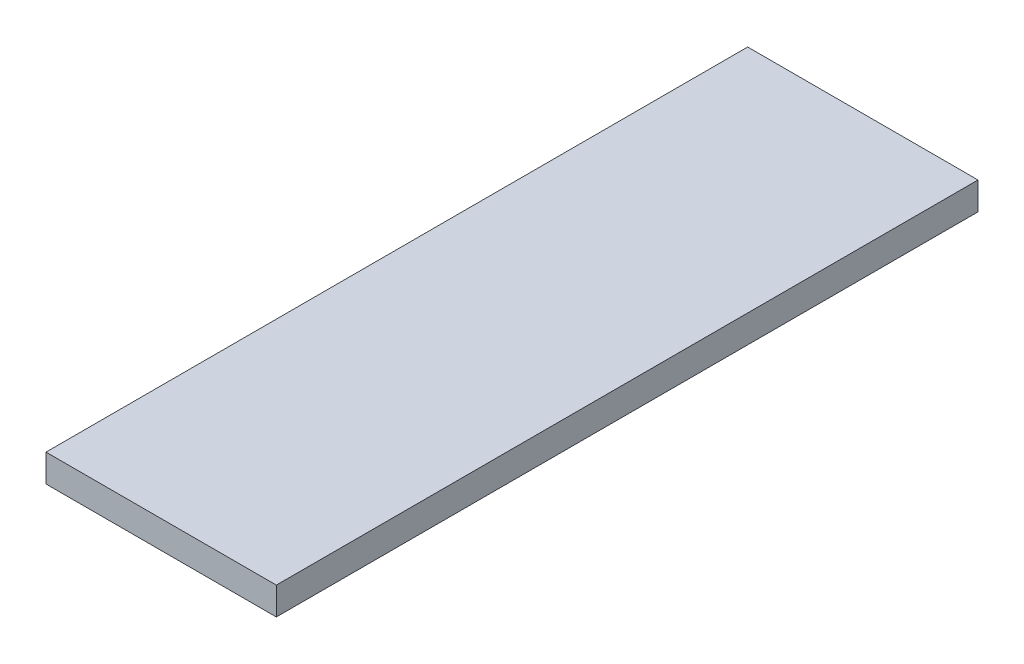
ISO-10303-21;
HEADER;
FILE_DESCRIPTION(('STEP AP214'),'2;1');
FILE_NAME('part.step','',(''),(''),'','','');
FILE_SCHEMA(('AUTOMOTIVE_DESIGN { 1 0 10303 214 1 1 1 1 }'));
ENDSEC;
DATA;
#1=APPLICATION_CONTEXT('core data for automotive mechanical design processes');
#2=APPLICATION_PROTOCOL_DEFINITION('international standard','automotive_design',2000,#1);
#3=PRODUCT_CONTEXT('',#1,'mechanical');
#4=PRODUCT('Part','Part','',(#3));
#5=PRODUCT_RELATED_PRODUCT_CATEGORY('part','',(#4));
#6=PRODUCT_DEFINITION_FORMATION('','',#4);
#7=PRODUCT_DEFINITION_CONTEXT('part definition',#1,'design');
#8=PRODUCT_DEFINITION('design','',#6,#7);
#9=PRODUCT_DEFINITION_SHAPE('','',#8);
#10=(LENGTH_UNIT() NAMED_UNIT(*) SI_UNIT(.MILLI.,.METRE.));
#11=(NAMED_UNIT(*) PLANE_ANGLE_UNIT() SI_UNIT($,.RADIAN.));
#12=(NAMED_UNIT(*) SI_UNIT($,.STERADIAN.) SOLID_ANGLE_UNIT());
#13=UNCERTAINTY_MEASURE_WITH_UNIT(LENGTH_MEASURE(1.E-05),#10,'distance_accuracy_value','');
#14=(GEOMETRIC_REPRESENTATION_CONTEXT(3) GLOBAL_UNCERTAINTY_ASSIGNED_CONTEXT((#13)) GLOBAL_UNIT_ASSIGNED_CONTEXT((#10,
#11,#12)) REPRESENTATION_CONTEXT('',''));
#15=CARTESIAN_POINT('',(0.,0.,0.));
#16=DIRECTION('',(0.,0.,1.));
#17=DIRECTION('',(1.,0.,0.));
#18=AXIS2_PLACEMENT_3D('',#15,#16,#17);
#19=CARTESIAN_POINT('',(6.25,1.5,-19.04));
#20=DIRECTION('',(-1.,0.,0.));
#21=DIRECTION('',(0.,0.,1.));
#22=AXIS2_PLACEMENT_3D('',#19,#20,#21);
#23=PLANE('',#22);
#24=DIRECTION('',(0.,0.,-1.));
#25=VECTOR('',#24,1.);
#26=CARTESIAN_POINT('',(6.25,0.,-19.04));
#27=LINE('',#26,#25);
#28=CARTESIAN_POINT('',(6.25,0.,19.04));
#29=VERTEX_POINT('',#28);
#30=CARTESIAN_POINT('',(6.25,0.,-19.04));
#31=VERTEX_POINT('',#30);
#32=EDGE_CURVE('E95',#29,#31,#27,.T.);
#33=ORIENTED_EDGE('',*,*,#32,.T.);
#34=DIRECTION('',(0.,-1.,0.));
#35=VECTOR('',#34,1.);
#36=CARTESIAN_POINT('',(6.25,1.5,-19.04));
#37=LINE('',#36,#35);
#38=CARTESIAN_POINT('',(6.25,1.5,-19.04));
#39=VERTEX_POINT('',#38);
#40=EDGE_CURVE('E11',#39,#31,#37,.T.);
#41=ORIENTED_EDGE('',*,*,#40,.F.);
#42=DIRECTION('',(0.,0.,-1.));
#43=VECTOR('',#42,1.);
#44=CARTESIAN_POINT('',(6.25,1.5,-19.04));
#45=LINE('',#44,#43);
#46=CARTESIAN_POINT('',(6.25,1.5,19.04));
#47=VERTEX_POINT('',#46);
#48=EDGE_CURVE('E83',#47,#39,#45,.T.);
#49=ORIENTED_EDGE('',*,*,#48,.F.);
#50=DIRECTION('',(0.,-1.,0.));
#51=VECTOR('',#50,1.);
#52=CARTESIAN_POINT('',(6.25,1.5,19.04));
#53=LINE('',#52,#51);
#54=EDGE_CURVE('E91',#47,#29,#53,.T.);
#55=ORIENTED_EDGE('',*,*,#54,.T.);
#56=EDGE_LOOP('',(#33,#41,#49,#55));
#57=FACE_BOUND('',#56,.T.);
#58=ADVANCED_FACE('F32',(#57),#23,.F.);
#59=CARTESIAN_POINT('',(-6.25,1.5,-19.04));
#60=DIRECTION('',(0.,0.,1.));
#61=DIRECTION('',(1.,0.,0.));
#62=AXIS2_PLACEMENT_3D('',#59,#60,#61);
#63=PLANE('',#62);
#64=DIRECTION('',(-1.,0.,0.));
#65=VECTOR('',#64,1.);
#66=CARTESIAN_POINT('',(-6.25,0.,-19.04));
#67=LINE('',#66,#65);
#68=CARTESIAN_POINT('',(-6.25,0.,-19.04));
#69=VERTEX_POINT('',#68);
#70=EDGE_CURVE('E87',#31,#69,#67,.T.);
#71=ORIENTED_EDGE('',*,*,#70,.T.);
#72=DIRECTION('',(0.,-1.,0.));
#73=VECTOR('',#72,1.);
#74=CARTESIAN_POINT('',(-6.25,1.5,-19.04));
#75=LINE('',#74,#73);
#76=CARTESIAN_POINT('',(-6.25,1.5,-19.04));
#77=VERTEX_POINT('',#76);
#78=EDGE_CURVE('E40',#77,#69,#75,.T.);
#79=ORIENTED_EDGE('',*,*,#78,.F.);
#80=DIRECTION('',(-1.,0.,0.));
#81=VECTOR('',#80,1.);
#82=CARTESIAN_POINT('',(-6.25,1.5,-19.04));
#83=LINE('',#82,#81);
#84=EDGE_CURVE('E78',#39,#77,#83,.T.);
#85=ORIENTED_EDGE('',*,*,#84,.F.);
#86=ORIENTED_EDGE('',*,*,#40,.T.);
#87=EDGE_LOOP('',(#71,#79,#85,#86));
#88=FACE_BOUND('',#87,.T.);
#89=ADVANCED_FACE('F86',(#88),#63,.F.);
#90=CARTESIAN_POINT('',(-6.25,1.5,-19.04));
#91=DIRECTION('',(1.,0.,0.));
#92=DIRECTION('',(0.,0.,-1.));
#93=AXIS2_PLACEMENT_3D('',#90,#91,#92);
#94=PLANE('',#93);
#95=DIRECTION('',(0.,0.,1.));
#96=VECTOR('',#95,1.);
#97=CARTESIAN_POINT('',(-6.25,0.,-19.04));
#98=LINE('',#97,#96);
#99=CARTESIAN_POINT('',(-6.25,0.,19.04));
#100=VERTEX_POINT('',#99);
#101=EDGE_CURVE('E65',#69,#100,#98,.T.);
#102=ORIENTED_EDGE('',*,*,#101,.T.);
#103=DIRECTION('',(0.,-1.,0.));
#104=VECTOR('',#103,1.);
#105=CARTESIAN_POINT('',(-6.25,1.5,19.04));
#106=LINE('',#105,#104);
#107=CARTESIAN_POINT('',(-6.25,1.5,19.04));
#108=VERTEX_POINT('',#107);
#109=EDGE_CURVE('E88',#108,#100,#106,.T.);
#110=ORIENTED_EDGE('',*,*,#109,.F.);
#111=DIRECTION('',(0.,0.,1.));
#112=VECTOR('',#111,1.);
#113=CARTESIAN_POINT('',(-6.25,1.5,-19.04));
#114=LINE('',#113,#112);
#115=EDGE_CURVE('E81',#77,#108,#114,.T.);
#116=ORIENTED_EDGE('',*,*,#115,.F.);
#117=ORIENTED_EDGE('',*,*,#78,.T.);
#118=EDGE_LOOP('',(#102,#110,#116,#117));
#119=FACE_BOUND('',#118,.T.);
#120=ADVANCED_FACE('F89',(#119),#94,.F.);
#121=CARTESIAN_POINT('',(-6.25,1.5,19.04));
#122=DIRECTION('',(0.,0.,-1.));
#123=DIRECTION('',(-1.,0.,0.));
#124=AXIS2_PLACEMENT_3D('',#121,#122,#123);
#125=PLANE('',#124);
#126=DIRECTION('',(1.,0.,0.));
#127=VECTOR('',#126,1.);
#128=CARTESIAN_POINT('',(-6.25,0.,19.04));
#129=LINE('',#128,#127);
#130=EDGE_CURVE('E71',#100,#29,#129,.T.);
#131=ORIENTED_EDGE('',*,*,#130,.T.);
#132=ORIENTED_EDGE('',*,*,#54,.F.);
#133=DIRECTION('',(1.,0.,0.));
#134=VECTOR('',#133,1.);
#135=CARTESIAN_POINT('',(-6.25,1.5,19.04));
#136=LINE('',#135,#134);
#137=EDGE_CURVE('E48',#108,#47,#136,.T.);
#138=ORIENTED_EDGE('',*,*,#137,.F.);
#139=ORIENTED_EDGE('',*,*,#109,.T.);
#140=EDGE_LOOP('',(#131,#132,#138,#139));
#141=FACE_BOUND('',#140,.T.);
#142=ADVANCED_FACE('F102',(#141),#125,.F.);
#143=CARTESIAN_POINT('',(0.,1.5,0.));
#144=DIRECTION('',(0.,1.,0.));
#145=DIRECTION('',(0.,0.,1.));
#146=AXIS2_PLACEMENT_3D('',#143,#144,#145);
#147=PLANE('',#146);
#148=ORIENTED_EDGE('',*,*,#48,.T.);
#149=ORIENTED_EDGE('',*,*,#84,.T.);
#150=ORIENTED_EDGE('',*,*,#115,.T.);
#151=ORIENTED_EDGE('',*,*,#137,.T.);
#152=EDGE_LOOP('',(#148,#149,#150,#151));
#153=FACE_BOUND('',#152,.T.);
#154=ADVANCED_FACE('F79',(#153),#147,.T.);
#155=CARTESIAN_POINT('',(0.,0.,0.));
#156=DIRECTION('',(0.,1.,0.));
#157=DIRECTION('',(0.,0.,1.));
#158=AXIS2_PLACEMENT_3D('',#155,#156,#157);
#159=PLANE('',#158);
#160=ORIENTED_EDGE('',*,*,#32,.F.);
#161=ORIENTED_EDGE('',*,*,#130,.F.);
#162=ORIENTED_EDGE('',*,*,#101,.F.);
#163=ORIENTED_EDGE('',*,*,#70,.F.);
#164=EDGE_LOOP('',(#160,#161,#162,#163));
#165=FACE_BOUND('',#164,.T.);
#166=ADVANCED_FACE('F105',(#165),#159,.F.);
#167=CLOSED_SHELL('',(#58,#89,#120,#142,#154,#166));
#168=MANIFOLD_SOLID_BREP('B2',#167);
#169=ADVANCED_BREP_SHAPE_REPRESENTATION('',(#18,#168),#14);
#170=SHAPE_DEFINITION_REPRESENTATION(#9,#169);
ENDSEC;
END-ISO-10303-21;
